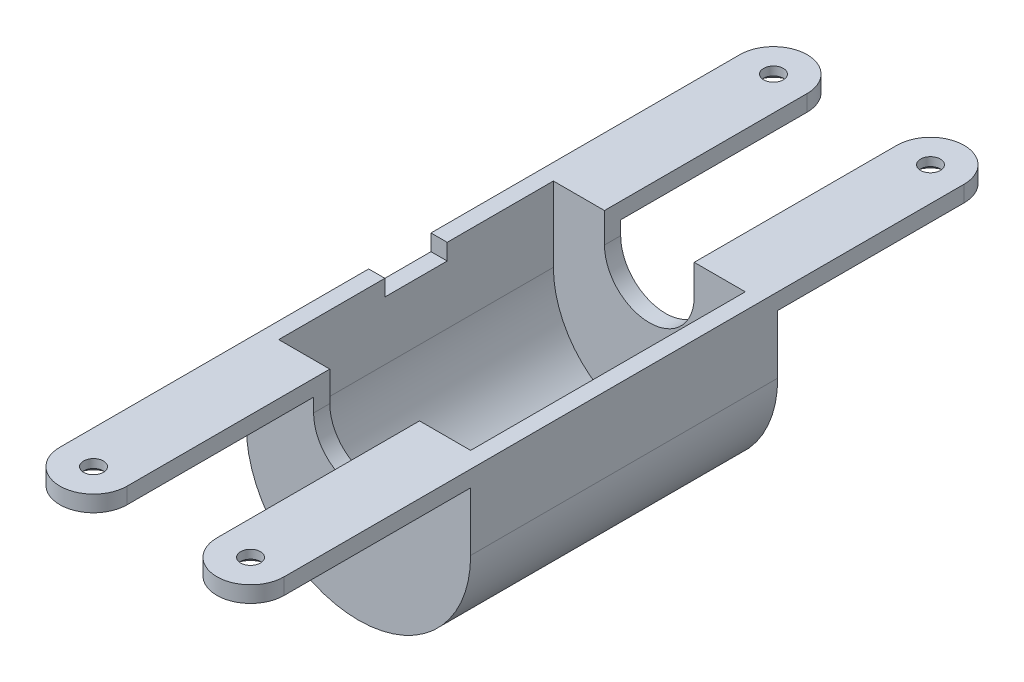
ISO-10303-21;
HEADER;
FILE_DESCRIPTION(('STEP AP214'),'2;1');
FILE_NAME('part.step','',(''),(''),'','','');
FILE_SCHEMA(('AUTOMOTIVE_DESIGN { 1 0 10303 214 1 1 1 1 }'));
ENDSEC;
DATA;
#1=APPLICATION_CONTEXT('core data for automotive mechanical design processes');
#2=APPLICATION_PROTOCOL_DEFINITION('international standard','automotive_design',2000,#1);
#3=PRODUCT_CONTEXT('',#1,'mechanical');
#4=PRODUCT('Part','Part','',(#3));
#5=PRODUCT_RELATED_PRODUCT_CATEGORY('part','',(#4));
#6=PRODUCT_DEFINITION_FORMATION('','',#4);
#7=PRODUCT_DEFINITION_CONTEXT('part definition',#1,'design');
#8=PRODUCT_DEFINITION('design','',#6,#7);
#9=PRODUCT_DEFINITION_SHAPE('','',#8);
#10=(LENGTH_UNIT() NAMED_UNIT(*) SI_UNIT(.MILLI.,.METRE.));
#11=(NAMED_UNIT(*) PLANE_ANGLE_UNIT() SI_UNIT($,.RADIAN.));
#12=(NAMED_UNIT(*) SI_UNIT($,.STERADIAN.) SOLID_ANGLE_UNIT());
#13=UNCERTAINTY_MEASURE_WITH_UNIT(LENGTH_MEASURE(1.E-05),#10,'distance_accuracy_value','');
#14=(GEOMETRIC_REPRESENTATION_CONTEXT(3) GLOBAL_UNCERTAINTY_ASSIGNED_CONTEXT((#13)) GLOBAL_UNIT_ASSIGNED_CONTEXT((#10,
#11,#12)) REPRESENTATION_CONTEXT('',''));
#15=CARTESIAN_POINT('',(0.,0.,0.));
#16=DIRECTION('',(0.,0.,1.));
#17=DIRECTION('',(1.,0.,0.));
#18=AXIS2_PLACEMENT_3D('',#15,#16,#17);
#19=CARTESIAN_POINT('',(-22.86,29.845,190.373));
#20=DIRECTION('',(-1.,0.,0.));
#21=DIRECTION('',(0.,-1.,0.));
#22=AXIS2_PLACEMENT_3D('',#19,#20,#21);
#23=PLANE('',#22);
#24=DIRECTION('',(0.,-1.,0.));
#25=VECTOR('',#24,1.);
#26=CARTESIAN_POINT('',(-22.8600000000001,432.243454709471,173.228));
#27=LINE('',#26,#25);
#28=CARTESIAN_POINT('',(-22.86,38.1,173.228));
#29=VERTEX_POINT('',#28);
#30=CARTESIAN_POINT('',(-22.86,29.845,173.228));
#31=VERTEX_POINT('',#30);
#32=EDGE_CURVE('E450',#29,#31,#27,.T.);
#33=ORIENTED_EDGE('',*,*,#32,.T.);
#34=DIRECTION('',(0.,0.,-1.));
#35=VECTOR('',#34,1.);
#36=CARTESIAN_POINT('',(-22.86,29.845,190.373));
#37=LINE('',#36,#35);
#38=CARTESIAN_POINT('',(-22.86,29.845,78.232));
#39=VERTEX_POINT('',#38);
#40=EDGE_CURVE('E47',#31,#39,#37,.T.);
#41=ORIENTED_EDGE('',*,*,#40,.T.);
#42=DIRECTION('',(0.,1.,0.));
#43=VECTOR('',#42,1.);
#44=CARTESIAN_POINT('',(-22.86,38.1,78.232));
#45=LINE('',#44,#43);
#46=CARTESIAN_POINT('',(-22.86,22.86,78.232));
#47=VERTEX_POINT('',#46);
#48=EDGE_CURVE('E314',#47,#39,#45,.T.);
#49=ORIENTED_EDGE('',*,*,#48,.F.);
#50=DIRECTION('',(0.,0.,-1.));
#51=VECTOR('',#50,1.);
#52=CARTESIAN_POINT('',(-22.86,22.86,78.232));
#53=LINE('',#52,#51);
#54=CARTESIAN_POINT('',(-22.86,22.86,69.977));
#55=VERTEX_POINT('',#54);
#56=EDGE_CURVE('E343',#47,#55,#53,.T.);
#57=ORIENTED_EDGE('',*,*,#56,.T.);
#58=DIRECTION('',(0.,1.,0.));
#59=VECTOR('',#58,1.);
#60=CARTESIAN_POINT('',(-22.86,22.86,69.977));
#61=LINE('',#60,#59);
#62=CARTESIAN_POINT('',(-22.86,38.1,69.977));
#63=VERTEX_POINT('',#62);
#64=EDGE_CURVE('E284',#55,#63,#61,.T.);
#65=ORIENTED_EDGE('',*,*,#64,.T.);
#66=DIRECTION('',(0.,0.,-1.));
#67=VECTOR('',#66,1.);
#68=CARTESIAN_POINT('',(-22.86,38.1,190.373));
#69=LINE('',#68,#67);
#70=EDGE_CURVE('E231',#29,#63,#69,.T.);
#71=ORIENTED_EDGE('',*,*,#70,.F.);
#72=EDGE_LOOP('',(#33,#41,#49,#57,#65,#71));
#73=FACE_BOUND('',#72,.T.);
#74=ADVANCED_FACE('F39',(#73),#23,.F.);
#75=CARTESIAN_POINT('',(-57.15,38.1,190.373));
#76=DIRECTION('',(1.,0.,0.));
#77=DIRECTION('',(0.,0.,-1.));
#78=AXIS2_PLACEMENT_3D('',#75,#76,#77);
#79=PLANE('',#78);
#80=DIRECTION('',(0.,0.,-1.));
#81=VECTOR('',#80,1.);
#82=CARTESIAN_POINT('',(-57.15,29.845,190.373));
#83=LINE('',#82,#81);
#84=CARTESIAN_POINT('',(-57.15,29.845,173.228));
#85=VERTEX_POINT('',#84);
#86=CARTESIAN_POINT('',(-57.15,29.845,78.232));
#87=VERTEX_POINT('',#86);
#88=EDGE_CURVE('E11',#85,#87,#83,.T.);
#89=ORIENTED_EDGE('',*,*,#88,.F.);
#90=DIRECTION('',(0.,-1.,0.));
#91=VECTOR('',#90,1.);
#92=CARTESIAN_POINT('',(-57.1500000000002,432.243454709471,173.228));
#93=LINE('',#92,#91);
#94=CARTESIAN_POINT('',(-57.15,38.1,173.228));
#95=VERTEX_POINT('',#94);
#96=EDGE_CURVE('E229',#95,#85,#93,.T.);
#97=ORIENTED_EDGE('',*,*,#96,.F.);
#98=DIRECTION('',(0.,0.,-1.));
#99=VECTOR('',#98,1.);
#100=CARTESIAN_POINT('',(-57.15,38.1,190.373));
#101=LINE('',#100,#99);
#102=CARTESIAN_POINT('',(-57.15,38.1,15.875));
#103=VERTEX_POINT('',#102);
#104=EDGE_CURVE('E224',#95,#103,#101,.T.);
#105=ORIENTED_EDGE('',*,*,#104,.T.);
#106=DIRECTION('',(0.,-1.,0.));
#107=VECTOR('',#106,1.);
#108=CARTESIAN_POINT('',(-57.15,38.1,15.875));
#109=LINE('',#108,#107);
#110=CARTESIAN_POINT('',(-57.15,29.845,15.875));
#111=VERTEX_POINT('',#110);
#112=EDGE_CURVE('E228',#103,#111,#109,.T.);
#113=ORIENTED_EDGE('',*,*,#112,.T.);
#114=DIRECTION('',(0.,0.,-1.));
#115=VECTOR('',#114,1.);
#116=CARTESIAN_POINT('',(-57.15,29.845,15.875));
#117=LINE('',#116,#115);
#118=CARTESIAN_POINT('',(-57.15,29.845,-15.875));
#119=VERTEX_POINT('',#118);
#120=EDGE_CURVE('E241',#111,#119,#117,.T.);
#121=ORIENTED_EDGE('',*,*,#120,.T.);
#122=DIRECTION('',(0.,1.,0.));
#123=VECTOR('',#122,1.);
#124=CARTESIAN_POINT('',(-57.15,29.845,-15.875));
#125=LINE('',#124,#123);
#126=CARTESIAN_POINT('',(-57.15,38.1,-15.875));
#127=VERTEX_POINT('',#126);
#128=EDGE_CURVE('E248',#119,#127,#125,.T.);
#129=ORIENTED_EDGE('',*,*,#128,.T.);
#130=DIRECTION('',(0.,0.,1.));
#131=VECTOR('',#130,1.);
#132=CARTESIAN_POINT('',(-57.15,38.1,-190.373));
#133=LINE('',#132,#131);
#134=CARTESIAN_POINT('',(-57.15,38.1,-173.228));
#135=VERTEX_POINT('',#134);
#136=EDGE_CURVE('E402',#135,#127,#133,.T.);
#137=ORIENTED_EDGE('',*,*,#136,.F.);
#138=DIRECTION('',(0.,-1.,0.));
#139=VECTOR('',#138,1.);
#140=CARTESIAN_POINT('',(-57.1500000000002,432.243454709471,-173.228));
#141=LINE('',#140,#139);
#142=CARTESIAN_POINT('',(-57.15,29.845,-173.228));
#143=VERTEX_POINT('',#142);
#144=EDGE_CURVE('E389',#135,#143,#141,.T.);
#145=ORIENTED_EDGE('',*,*,#144,.T.);
#146=DIRECTION('',(0.,0.,1.));
#147=VECTOR('',#146,1.);
#148=CARTESIAN_POINT('',(-57.15,29.845,-190.373));
#149=LINE('',#148,#147);
#150=CARTESIAN_POINT('',(-57.15,29.845,-78.232));
#151=VERTEX_POINT('',#150);
#152=EDGE_CURVE('E408',#143,#151,#149,.T.);
#153=ORIENTED_EDGE('',*,*,#152,.T.);
#154=DIRECTION('',(0.,-1.,0.));
#155=VECTOR('',#154,1.);
#156=CARTESIAN_POINT('',(-57.15,38.1,-78.232));
#157=LINE('',#156,#155);
#158=CARTESIAN_POINT('',(-57.15,0.,-78.232));
#159=VERTEX_POINT('',#158);
#160=EDGE_CURVE('E331',#151,#159,#157,.T.);
#161=ORIENTED_EDGE('',*,*,#160,.T.);
#162=DIRECTION('',(0.,0.,-1.));
#163=VECTOR('',#162,1.);
#164=CARTESIAN_POINT('',(-57.15,0.,78.232));
#165=LINE('',#164,#163);
#166=CARTESIAN_POINT('',(-57.15,0.,78.232));
#167=VERTEX_POINT('',#166);
#168=EDGE_CURVE('E339',#167,#159,#165,.T.);
#169=ORIENTED_EDGE('',*,*,#168,.F.);
#170=DIRECTION('',(0.,-1.,0.));
#171=VECTOR('',#170,1.);
#172=CARTESIAN_POINT('',(-57.15,38.1,78.232));
#173=LINE('',#172,#171);
#174=EDGE_CURVE('E316',#87,#167,#173,.T.);
#175=ORIENTED_EDGE('',*,*,#174,.F.);
#176=EDGE_LOOP('',(#89,#97,#105,#113,#121,#129,#137,#145,#153,#161,#169,#175));
#177=FACE_BOUND('',#176,.T.);
#178=ADVANCED_FACE('F41',(#177),#79,.F.);
#179=CARTESIAN_POINT('',(-57.15,29.845,190.373));
#180=DIRECTION('',(0.,1.,0.));
#181=DIRECTION('',(0.,0.,1.));
#182=AXIS2_PLACEMENT_3D('',#179,#180,#181);
#183=PLANE('',#182);
#184=CARTESIAN_POINT('',(-40.005,29.845,173.228));
#185=DIRECTION('',(0.,-1.,0.));
#186=DIRECTION('',(0.,0.,-1.));
#187=AXIS2_PLACEMENT_3D('',#184,#185,#186);
#188=CIRCLE('',#187,9.6774);
#189=CARTESIAN_POINT('',(-40.005,29.845,163.5506));
#190=VERTEX_POINT('',#189);
#191=EDGE_CURVE('E441',#190,#190,#188,.T.);
#192=ORIENTED_EDGE('',*,*,#191,.F.);
#193=EDGE_LOOP('',(#192));
#194=FACE_BOUND('',#193,.T.);
#195=CARTESIAN_POINT('',(-40.005,29.845,173.228));
#196=DIRECTION('',(0.,1.,0.));
#197=DIRECTION('',(0.,0.,1.));
#198=AXIS2_PLACEMENT_3D('',#195,#196,#197);
#199=CIRCLE('',#198,17.145);
#200=EDGE_CURVE('E61',#31,#85,#199,.F.);
#201=ORIENTED_EDGE('',*,*,#200,.T.);
#202=ORIENTED_EDGE('',*,*,#88,.T.);
#203=DIRECTION('',(1.,0.,0.));
#204=VECTOR('',#203,1.);
#205=CARTESIAN_POINT('',(-57.15,29.845,78.232));
#206=LINE('',#205,#204);
#207=EDGE_CURVE('E232',#87,#39,#206,.T.);
#208=ORIENTED_EDGE('',*,*,#207,.T.);
#209=ORIENTED_EDGE('',*,*,#40,.F.);
#210=EDGE_LOOP('',(#201,#202,#208,#209));
#211=FACE_BOUND('',#210,.T.);
#212=ADVANCED_FACE('F462',(#194,#211),#183,.F.);
#213=CARTESIAN_POINT('',(-22.86,38.1,190.373));
#214=DIRECTION('',(0.,-1.,0.));
#215=DIRECTION('',(1.,0.,0.));
#216=AXIS2_PLACEMENT_3D('',#213,#214,#215);
#217=PLANE('',#216);
#218=CARTESIAN_POINT('',(-40.005,38.1,173.228));
#219=DIRECTION('',(0.,-1.,0.));
#220=DIRECTION('',(0.,0.,-1.));
#221=AXIS2_PLACEMENT_3D('',#218,#219,#220);
#222=CIRCLE('',#221,5.0419);
#223=CARTESIAN_POINT('',(-40.005,38.1,168.1861));
#224=VERTEX_POINT('',#223);
#225=EDGE_CURVE('E447',#224,#224,#222,.T.);
#226=ORIENTED_EDGE('',*,*,#225,.T.);
#227=EDGE_LOOP('',(#226));
#228=FACE_BOUND('',#227,.T.);
#229=ORIENTED_EDGE('',*,*,#104,.F.);
#230=CARTESIAN_POINT('',(-40.005,38.1,173.228));
#231=DIRECTION('',(0.,-1.,0.));
#232=DIRECTION('',(1.,0.,0.));
#233=AXIS2_PLACEMENT_3D('',#230,#231,#232);
#234=CIRCLE('',#233,17.145);
#235=EDGE_CURVE('E54',#95,#29,#234,.F.);
#236=ORIENTED_EDGE('',*,*,#235,.T.);
#237=ORIENTED_EDGE('',*,*,#70,.T.);
#238=DIRECTION('',(-1.,0.,0.));
#239=VECTOR('',#238,1.);
#240=CARTESIAN_POINT('',(0.,38.1,69.977));
#241=LINE('',#240,#239);
#242=CARTESIAN_POINT('',(-48.895,38.1,69.977));
#243=VERTEX_POINT('',#242);
#244=EDGE_CURVE('E268',#63,#243,#241,.T.);
#245=ORIENTED_EDGE('',*,*,#244,.T.);
#246=DIRECTION('',(0.,0.,-1.));
#247=VECTOR('',#246,1.);
#248=CARTESIAN_POINT('',(-48.895,38.1,78.232));
#249=LINE('',#248,#247);
#250=CARTESIAN_POINT('',(-48.895,38.1,15.875));
#251=VERTEX_POINT('',#250);
#252=EDGE_CURVE('E247',#243,#251,#249,.T.);
#253=ORIENTED_EDGE('',*,*,#252,.T.);
#254=DIRECTION('',(1.,0.,0.));
#255=VECTOR('',#254,1.);
#256=CARTESIAN_POINT('',(-57.15,38.1,15.875));
#257=LINE('',#256,#255);
#258=EDGE_CURVE('E237',#103,#251,#257,.T.);
#259=ORIENTED_EDGE('',*,*,#258,.F.);
#260=EDGE_LOOP('',(#229,#236,#237,#245,#253,#259));
#261=FACE_BOUND('',#260,.T.);
#262=ADVANCED_FACE('F245',(#228,#261),#217,.F.);
#263=CARTESIAN_POINT('',(-40.0050000000001,432.243454709471,173.228));
#264=DIRECTION('',(0.,-1.,0.));
#265=DIRECTION('',(1.,0.,0.));
#266=AXIS2_PLACEMENT_3D('',#263,#264,#265);
#267=CYLINDRICAL_SURFACE('',#266,17.145);
#268=ORIENTED_EDGE('',*,*,#96,.T.);
#269=ORIENTED_EDGE('',*,*,#200,.F.);
#270=ORIENTED_EDGE('',*,*,#32,.F.);
#271=ORIENTED_EDGE('',*,*,#235,.F.);
#272=EDGE_LOOP('',(#268,#269,#270,#271));
#273=FACE_BOUND('',#272,.T.);
#274=ADVANCED_FACE('F560',(#273),#267,.T.);
#275=CARTESIAN_POINT('',(-40.005,29.845,173.228));
#276=DIRECTION('',(0.,-1.,0.));
#277=DIRECTION('',(0.,0.,-1.));
#278=AXIS2_PLACEMENT_3D('',#275,#276,#277);
#279=CYLINDRICAL_SURFACE('',#278,5.0419);
#280=ORIENTED_EDGE('',*,*,#225,.F.);
#281=EDGE_LOOP('',(#280));
#282=FACE_BOUND('',#281,.T.);
#283=CARTESIAN_POINT('',(-40.005,33.7346463403223,173.228));
#284=DIRECTION('',(0.,-1.,0.));
#285=DIRECTION('',(0.,0.,-1.));
#286=AXIS2_PLACEMENT_3D('',#283,#284,#285);
#287=CIRCLE('',#286,5.0419);
#288=CARTESIAN_POINT('',(-40.005,33.7346463403223,168.1861));
#289=VERTEX_POINT('',#288);
#290=EDGE_CURVE('E444',#289,#289,#287,.T.);
#291=ORIENTED_EDGE('',*,*,#290,.T.);
#292=EDGE_LOOP('',(#291));
#293=FACE_BOUND('',#292,.T.);
#294=ADVANCED_FACE('F566',(#282,#293),#279,.F.);
#295=CARTESIAN_POINT('',(-40.005,29.845,173.228));
#296=DIRECTION('',(0.,-1.,0.));
#297=DIRECTION('',(0.,0.,-1.));
#298=AXIS2_PLACEMENT_3D('',#295,#296,#297);
#299=CONICAL_SURFACE('',#298,9.6774,0.872664625997164);
#300=ORIENTED_EDGE('',*,*,#290,.F.);
#301=EDGE_LOOP('',(#300));
#302=FACE_BOUND('',#301,.T.);
#303=ORIENTED_EDGE('',*,*,#191,.T.);
#304=EDGE_LOOP('',(#303));
#305=FACE_BOUND('',#304,.T.);
#306=ADVANCED_FACE('F564',(#302,#305),#299,.F.);
#307=CARTESIAN_POINT('',(0.,22.86,78.232));
#308=DIRECTION('',(0.,0.,-1.));
#309=DIRECTION('',(-1.,0.,0.));
#310=AXIS2_PLACEMENT_3D('',#307,#308,#309);
#311=PLANE('',#310);
#312=ORIENTED_EDGE('',*,*,#48,.T.);
#313=ORIENTED_EDGE('',*,*,#207,.F.);
#314=ORIENTED_EDGE('',*,*,#174,.T.);
#315=CARTESIAN_POINT('',(0.,0.,78.232));
#316=DIRECTION('',(0.,0.,1.));
#317=DIRECTION('',(-1.,0.,0.));
#318=AXIS2_PLACEMENT_3D('',#315,#316,#317);
#319=CIRCLE('',#318,57.15);
#320=CARTESIAN_POINT('',(57.15,0.,78.232));
#321=VERTEX_POINT('',#320);
#322=EDGE_CURVE('E318',#167,#321,#319,.T.);
#323=ORIENTED_EDGE('',*,*,#322,.T.);
#324=DIRECTION('',(0.,1.,0.));
#325=VECTOR('',#324,1.);
#326=CARTESIAN_POINT('',(57.15,38.1,78.232));
#327=LINE('',#326,#325);
#328=CARTESIAN_POINT('',(57.15,29.845,78.232));
#329=VERTEX_POINT('',#328);
#330=EDGE_CURVE('E320',#321,#329,#327,.T.);
#331=ORIENTED_EDGE('',*,*,#330,.T.);
#332=DIRECTION('',(-1.,0.,0.));
#333=VECTOR('',#332,1.);
#334=CARTESIAN_POINT('',(57.15,29.845,78.232));
#335=LINE('',#334,#333);
#336=CARTESIAN_POINT('',(22.86,29.845,78.232));
#337=VERTEX_POINT('',#336);
#338=EDGE_CURVE('E428',#329,#337,#335,.T.);
#339=ORIENTED_EDGE('',*,*,#338,.T.);
#340=DIRECTION('',(0.,-1.,0.));
#341=VECTOR('',#340,1.);
#342=CARTESIAN_POINT('',(22.86,38.1,78.232));
#343=LINE('',#342,#341);
#344=CARTESIAN_POINT('',(22.86,22.86,78.232));
#345=VERTEX_POINT('',#344);
#346=EDGE_CURVE('E309',#337,#345,#343,.T.);
#347=ORIENTED_EDGE('',*,*,#346,.T.);
#348=CARTESIAN_POINT('',(0.,22.86,78.232));
#349=DIRECTION('',(0.,0.,-1.));
#350=DIRECTION('',(-1.,0.,0.));
#351=AXIS2_PLACEMENT_3D('',#348,#349,#350);
#352=CIRCLE('',#351,22.86);
#353=EDGE_CURVE('E311',#345,#47,#352,.T.);
#354=ORIENTED_EDGE('',*,*,#353,.T.);
#355=EDGE_LOOP('',(#312,#313,#314,#323,#331,#339,#347,#354));
#356=FACE_BOUND('',#355,.T.);
#357=ADVANCED_FACE('F465',(#356),#311,.F.);
#358=CARTESIAN_POINT('',(22.86,29.845,190.373));
#359=DIRECTION('',(1.,0.,0.));
#360=DIRECTION('',(0.,-1.,0.));
#361=AXIS2_PLACEMENT_3D('',#358,#359,#360);
#362=PLANE('',#361);
#363=DIRECTION('',(0.,-1.,0.));
#364=VECTOR('',#363,1.);
#365=CARTESIAN_POINT('',(22.8600000000001,432.243454709471,173.228));
#366=LINE('',#365,#364);
#367=CARTESIAN_POINT('',(22.86,38.1,173.228));
#368=VERTEX_POINT('',#367);
#369=CARTESIAN_POINT('',(22.86,29.845,173.228));
#370=VERTEX_POINT('',#369);
#371=EDGE_CURVE('E420',#368,#370,#366,.T.);
#372=ORIENTED_EDGE('',*,*,#371,.F.);
#373=DIRECTION('',(0.,0.,-1.));
#374=VECTOR('',#373,1.);
#375=CARTESIAN_POINT('',(22.86,38.1,190.373));
#376=LINE('',#375,#374);
#377=CARTESIAN_POINT('',(22.86,38.1,69.977));
#378=VERTEX_POINT('',#377);
#379=EDGE_CURVE('E434',#368,#378,#376,.T.);
#380=ORIENTED_EDGE('',*,*,#379,.T.);
#381=DIRECTION('',(0.,-1.,0.));
#382=VECTOR('',#381,1.);
#383=CARTESIAN_POINT('',(22.86,22.86,69.977));
#384=LINE('',#383,#382);
#385=CARTESIAN_POINT('',(22.86,22.86,69.977));
#386=VERTEX_POINT('',#385);
#387=EDGE_CURVE('E290',#378,#386,#384,.T.);
#388=ORIENTED_EDGE('',*,*,#387,.T.);
#389=DIRECTION('',(0.,0.,-1.));
#390=VECTOR('',#389,1.);
#391=CARTESIAN_POINT('',(22.86,22.86,78.232));
#392=LINE('',#391,#390);
#393=EDGE_CURVE('E347',#345,#386,#392,.T.);
#394=ORIENTED_EDGE('',*,*,#393,.F.);
#395=ORIENTED_EDGE('',*,*,#346,.F.);
#396=DIRECTION('',(0.,0.,-1.));
#397=VECTOR('',#396,1.);
#398=CARTESIAN_POINT('',(22.86,29.845,190.373));
#399=LINE('',#398,#397);
#400=EDGE_CURVE('E436',#370,#337,#399,.T.);
#401=ORIENTED_EDGE('',*,*,#400,.F.);
#402=EDGE_LOOP('',(#372,#380,#388,#394,#395,#401));
#403=FACE_BOUND('',#402,.T.);
#404=ADVANCED_FACE('F486',(#403),#362,.F.);
#405=CARTESIAN_POINT('',(57.15,38.1,190.373));
#406=DIRECTION('',(-1.,0.,0.));
#407=DIRECTION('',(0.,0.,-1.));
#408=AXIS2_PLACEMENT_3D('',#405,#406,#407);
#409=PLANE('',#408);
#410=DIRECTION('',(0.,0.,-1.));
#411=VECTOR('',#410,1.);
#412=CARTESIAN_POINT('',(57.15,29.845,190.373));
#413=LINE('',#412,#411);
#414=CARTESIAN_POINT('',(57.15,29.845,173.228));
#415=VERTEX_POINT('',#414);
#416=EDGE_CURVE('E438',#415,#329,#413,.T.);
#417=ORIENTED_EDGE('',*,*,#416,.T.);
#418=ORIENTED_EDGE('',*,*,#330,.F.);
#419=DIRECTION('',(0.,0.,-1.));
#420=VECTOR('',#419,1.);
#421=CARTESIAN_POINT('',(57.15,0.,78.232));
#422=LINE('',#421,#420);
#423=CARTESIAN_POINT('',(57.15,0.,-78.232));
#424=VERTEX_POINT('',#423);
#425=EDGE_CURVE('E323',#321,#424,#422,.T.);
#426=ORIENTED_EDGE('',*,*,#425,.T.);
#427=DIRECTION('',(0.,1.,0.));
#428=VECTOR('',#427,1.);
#429=CARTESIAN_POINT('',(57.15,38.1,-78.232));
#430=LINE('',#429,#428);
#431=CARTESIAN_POINT('',(57.15,29.845,-78.232));
#432=VERTEX_POINT('',#431);
#433=EDGE_CURVE('E312',#424,#432,#430,.T.);
#434=ORIENTED_EDGE('',*,*,#433,.T.);
#435=DIRECTION('',(0.,0.,1.));
#436=VECTOR('',#435,1.);
#437=CARTESIAN_POINT('',(57.15,29.845,-190.373));
#438=LINE('',#437,#436);
#439=CARTESIAN_POINT('',(57.15,29.845,-173.228));
#440=VERTEX_POINT('',#439);
#441=EDGE_CURVE('E377',#440,#432,#438,.T.);
#442=ORIENTED_EDGE('',*,*,#441,.F.);
#443=DIRECTION('',(0.,-1.,0.));
#444=VECTOR('',#443,1.);
#445=CARTESIAN_POINT('',(57.1500000000002,432.243454709471,-173.228));
#446=LINE('',#445,#444);
#447=CARTESIAN_POINT('',(57.15,38.1,-173.228));
#448=VERTEX_POINT('',#447);
#449=EDGE_CURVE('E359',#448,#440,#446,.T.);
#450=ORIENTED_EDGE('',*,*,#449,.F.);
#451=DIRECTION('',(0.,0.,-1.));
#452=VECTOR('',#451,1.);
#453=CARTESIAN_POINT('',(57.15,38.1,190.373));
#454=LINE('',#453,#452);
#455=CARTESIAN_POINT('',(57.15,38.1,173.228));
#456=VERTEX_POINT('',#455);
#457=EDGE_CURVE('E432',#456,#448,#454,.T.);
#458=ORIENTED_EDGE('',*,*,#457,.F.);
#459=DIRECTION('',(0.,-1.,0.));
#460=VECTOR('',#459,1.);
#461=CARTESIAN_POINT('',(57.1500000000002,432.243454709471,173.228));
#462=LINE('',#461,#460);
#463=EDGE_CURVE('E419',#456,#415,#462,.T.);
#464=ORIENTED_EDGE('',*,*,#463,.T.);
#465=EDGE_LOOP('',(#417,#418,#426,#434,#442,#450,#458,#464));
#466=FACE_BOUND('',#465,.T.);
#467=ADVANCED_FACE('F476',(#466),#409,.F.);
#468=CARTESIAN_POINT('',(57.15,29.845,190.373));
#469=DIRECTION('',(0.,1.,0.));
#470=DIRECTION('',(0.,0.,1.));
#471=AXIS2_PLACEMENT_3D('',#468,#469,#470);
#472=PLANE('',#471);
#473=CARTESIAN_POINT('',(40.005,29.845,173.228));
#474=DIRECTION('',(0.,1.,0.));
#475=DIRECTION('',(0.,0.,-1.));
#476=AXIS2_PLACEMENT_3D('',#473,#474,#475);
#477=CIRCLE('',#476,9.6774);
#478=CARTESIAN_POINT('',(40.005,29.845,163.5506));
#479=VERTEX_POINT('',#478);
#480=EDGE_CURVE('E410',#479,#479,#477,.T.);
#481=ORIENTED_EDGE('',*,*,#480,.T.);
#482=EDGE_LOOP('',(#481));
#483=FACE_BOUND('',#482,.T.);
#484=CARTESIAN_POINT('',(40.005,29.845,173.228));
#485=DIRECTION('',(0.,-1.,0.));
#486=DIRECTION('',(0.,0.,1.));
#487=AXIS2_PLACEMENT_3D('',#484,#485,#486);
#488=CIRCLE('',#487,17.145);
#489=EDGE_CURVE('E423',#370,#415,#488,.F.);
#490=ORIENTED_EDGE('',*,*,#489,.F.);
#491=ORIENTED_EDGE('',*,*,#400,.T.);
#492=ORIENTED_EDGE('',*,*,#338,.F.);
#493=ORIENTED_EDGE('',*,*,#416,.F.);
#494=EDGE_LOOP('',(#490,#491,#492,#493));
#495=FACE_BOUND('',#494,.T.);
#496=ADVANCED_FACE('F482',(#483,#495),#472,.F.);
#497=CARTESIAN_POINT('',(22.86,38.1,190.373));
#498=DIRECTION('',(0.,-1.,0.));
#499=DIRECTION('',(-1.,0.,0.));
#500=AXIS2_PLACEMENT_3D('',#497,#498,#499);
#501=PLANE('',#500);
#502=CARTESIAN_POINT('',(40.005,38.1,173.228));
#503=DIRECTION('',(0.,1.,0.));
#504=DIRECTION('',(0.,0.,-1.));
#505=AXIS2_PLACEMENT_3D('',#502,#503,#504);
#506=CIRCLE('',#505,5.0419);
#507=CARTESIAN_POINT('',(40.005,38.1,168.1861));
#508=VERTEX_POINT('',#507);
#509=EDGE_CURVE('E416',#508,#508,#506,.T.);
#510=ORIENTED_EDGE('',*,*,#509,.F.);
#511=EDGE_LOOP('',(#510));
#512=FACE_BOUND('',#511,.T.);
#513=ORIENTED_EDGE('',*,*,#457,.T.);
#514=CARTESIAN_POINT('',(40.005,38.1,-173.228));
#515=DIRECTION('',(0.,-1.,0.));
#516=DIRECTION('',(-1.,0.,0.));
#517=AXIS2_PLACEMENT_3D('',#514,#515,#516);
#518=CIRCLE('',#517,17.145);
#519=CARTESIAN_POINT('',(22.86,38.1,-173.228));
#520=VERTEX_POINT('',#519);
#521=EDGE_CURVE('E366',#448,#520,#518,.F.);
#522=ORIENTED_EDGE('',*,*,#521,.T.);
#523=DIRECTION('',(0.,0.,1.));
#524=VECTOR('',#523,1.);
#525=CARTESIAN_POINT('',(22.86,38.1,-190.373));
#526=LINE('',#525,#524);
#527=CARTESIAN_POINT('',(22.86,38.1,-69.977));
#528=VERTEX_POINT('',#527);
#529=EDGE_CURVE('E372',#520,#528,#526,.T.);
#530=ORIENTED_EDGE('',*,*,#529,.T.);
#531=DIRECTION('',(-1.,0.,0.));
#532=VECTOR('',#531,1.);
#533=CARTESIAN_POINT('',(0.,38.1,-69.977));
#534=LINE('',#533,#532);
#535=CARTESIAN_POINT('',(48.895,38.1,-69.977));
#536=VERTEX_POINT('',#535);
#537=EDGE_CURVE('E277',#536,#528,#534,.T.);
#538=ORIENTED_EDGE('',*,*,#537,.F.);
#539=DIRECTION('',(0.,0.,-1.));
#540=VECTOR('',#539,1.);
#541=CARTESIAN_POINT('',(48.895,38.1,78.232));
#542=LINE('',#541,#540);
#543=CARTESIAN_POINT('',(48.895,38.1,69.977));
#544=VERTEX_POINT('',#543);
#545=EDGE_CURVE('E273',#544,#536,#542,.T.);
#546=ORIENTED_EDGE('',*,*,#545,.F.);
#547=DIRECTION('',(-1.,0.,0.));
#548=VECTOR('',#547,1.);
#549=CARTESIAN_POINT('',(0.,38.1,69.977));
#550=LINE('',#549,#548);
#551=EDGE_CURVE('E280',#544,#378,#550,.T.);
#552=ORIENTED_EDGE('',*,*,#551,.T.);
#553=ORIENTED_EDGE('',*,*,#379,.F.);
#554=CARTESIAN_POINT('',(40.005,38.1,173.228));
#555=DIRECTION('',(0.,1.,0.));
#556=DIRECTION('',(-1.,0.,0.));
#557=AXIS2_PLACEMENT_3D('',#554,#555,#556);
#558=CIRCLE('',#557,17.145);
#559=EDGE_CURVE('E426',#456,#368,#558,.F.);
#560=ORIENTED_EDGE('',*,*,#559,.F.);
#561=EDGE_LOOP('',(#513,#522,#530,#538,#546,#552,#553,#560));
#562=FACE_BOUND('',#561,.T.);
#563=CARTESIAN_POINT('',(40.005,38.1,-173.228));
#564=DIRECTION('',(0.,-1.,0.));
#565=DIRECTION('',(0.,0.,1.));
#566=AXIS2_PLACEMENT_3D('',#563,#564,#565);
#567=CIRCLE('',#566,5.0419);
#568=CARTESIAN_POINT('',(40.005,38.1,-168.1861));
#569=VERTEX_POINT('',#568);
#570=EDGE_CURVE('E356',#569,#569,#567,.T.);
#571=ORIENTED_EDGE('',*,*,#570,.T.);
#572=EDGE_LOOP('',(#571));
#573=FACE_BOUND('',#572,.T.);
#574=ADVANCED_FACE('F492',(#512,#562,#573),#501,.F.);
#575=CARTESIAN_POINT('',(40.0050000000001,432.243454709471,173.228));
#576=DIRECTION('',(0.,-1.,0.));
#577=DIRECTION('',(-1.,0.,0.));
#578=AXIS2_PLACEMENT_3D('',#575,#576,#577);
#579=CYLINDRICAL_SURFACE('',#578,17.145);
#580=ORIENTED_EDGE('',*,*,#463,.F.);
#581=ORIENTED_EDGE('',*,*,#559,.T.);
#582=ORIENTED_EDGE('',*,*,#371,.T.);
#583=ORIENTED_EDGE('',*,*,#489,.T.);
#584=EDGE_LOOP('',(#580,#581,#582,#583));
#585=FACE_BOUND('',#584,.T.);
#586=ADVANCED_FACE('F489',(#585),#579,.T.);
#587=CARTESIAN_POINT('',(40.005,29.845,173.228));
#588=DIRECTION('',(0.,-1.,0.));
#589=DIRECTION('',(0.,0.,-1.));
#590=AXIS2_PLACEMENT_3D('',#587,#588,#589);
#591=CYLINDRICAL_SURFACE('',#590,5.0419);
#592=ORIENTED_EDGE('',*,*,#509,.T.);
#593=EDGE_LOOP('',(#592));
#594=FACE_BOUND('',#593,.T.);
#595=CARTESIAN_POINT('',(40.005,33.7346463403223,173.228));
#596=DIRECTION('',(0.,1.,0.));
#597=DIRECTION('',(0.,0.,-1.));
#598=AXIS2_PLACEMENT_3D('',#595,#596,#597);
#599=CIRCLE('',#598,5.0419);
#600=CARTESIAN_POINT('',(40.005,33.7346463403223,168.1861));
#601=VERTEX_POINT('',#600);
#602=EDGE_CURVE('E413',#601,#601,#599,.T.);
#603=ORIENTED_EDGE('',*,*,#602,.F.);
#604=EDGE_LOOP('',(#603));
#605=FACE_BOUND('',#604,.T.);
#606=ADVANCED_FACE('F651',(#594,#605),#591,.F.);
#607=CARTESIAN_POINT('',(40.005,29.845,173.228));
#608=DIRECTION('',(0.,-1.,0.));
#609=DIRECTION('',(0.,0.,-1.));
#610=AXIS2_PLACEMENT_3D('',#607,#608,#609);
#611=CONICAL_SURFACE('',#610,9.6774,0.872664625997164);
#612=ORIENTED_EDGE('',*,*,#602,.T.);
#613=EDGE_LOOP('',(#612));
#614=FACE_BOUND('',#613,.T.);
#615=ORIENTED_EDGE('',*,*,#480,.F.);
#616=EDGE_LOOP('',(#615));
#617=FACE_BOUND('',#616,.T.);
#618=ADVANCED_FACE('F661',(#614,#617),#611,.F.);
#619=CARTESIAN_POINT('',(-22.86,29.845,-190.373));
#620=DIRECTION('',(-1.,0.,0.));
#621=DIRECTION('',(0.,-1.,0.));
#622=AXIS2_PLACEMENT_3D('',#619,#620,#621);
#623=PLANE('',#622);
#624=DIRECTION('',(0.,-1.,0.));
#625=VECTOR('',#624,1.);
#626=CARTESIAN_POINT('',(-22.8600000000001,432.243454709471,-173.228));
#627=LINE('',#626,#625);
#628=CARTESIAN_POINT('',(-22.86,38.1,-173.228));
#629=VERTEX_POINT('',#628);
#630=CARTESIAN_POINT('',(-22.86,29.845,-173.228));
#631=VERTEX_POINT('',#630);
#632=EDGE_CURVE('E390',#629,#631,#627,.T.);
#633=ORIENTED_EDGE('',*,*,#632,.F.);
#634=DIRECTION('',(0.,0.,1.));
#635=VECTOR('',#634,1.);
#636=CARTESIAN_POINT('',(-22.86,38.1,-190.373));
#637=LINE('',#636,#635);
#638=CARTESIAN_POINT('',(-22.86,38.1,-69.977));
#639=VERTEX_POINT('',#638);
#640=EDGE_CURVE('E404',#629,#639,#637,.T.);
#641=ORIENTED_EDGE('',*,*,#640,.T.);
#642=DIRECTION('',(0.,1.,0.));
#643=VECTOR('',#642,1.);
#644=CARTESIAN_POINT('',(-22.86,22.86,-69.977));
#645=LINE('',#644,#643);
#646=CARTESIAN_POINT('',(-22.86,22.86,-69.977));
#647=VERTEX_POINT('',#646);
#648=EDGE_CURVE('E304',#647,#639,#645,.T.);
#649=ORIENTED_EDGE('',*,*,#648,.F.);
#650=CARTESIAN_POINT('',(-22.86,22.86,-78.232));
#651=VERTEX_POINT('',#650);
#652=EDGE_CURVE('E342',#647,#651,#53,.T.);
#653=ORIENTED_EDGE('',*,*,#652,.T.);
#654=DIRECTION('',(0.,1.,0.));
#655=VECTOR('',#654,1.);
#656=CARTESIAN_POINT('',(-22.86,38.1,-78.232));
#657=LINE('',#656,#655);
#658=CARTESIAN_POINT('',(-22.86,29.845,-78.232));
#659=VERTEX_POINT('',#658);
#660=EDGE_CURVE('E328',#651,#659,#657,.T.);
#661=ORIENTED_EDGE('',*,*,#660,.T.);
#662=DIRECTION('',(0.,0.,1.));
#663=VECTOR('',#662,1.);
#664=CARTESIAN_POINT('',(-22.86,29.845,-190.373));
#665=LINE('',#664,#663);
#666=EDGE_CURVE('E406',#631,#659,#665,.T.);
#667=ORIENTED_EDGE('',*,*,#666,.F.);
#668=EDGE_LOOP('',(#633,#641,#649,#653,#661,#667));
#669=FACE_BOUND('',#668,.T.);
#670=ADVANCED_FACE('F671',(#669),#623,.F.);
#671=CARTESIAN_POINT('',(-57.15,29.845,-190.373));
#672=DIRECTION('',(0.,1.,0.));
#673=DIRECTION('',(0.,0.,-1.));
#674=AXIS2_PLACEMENT_3D('',#671,#672,#673);
#675=PLANE('',#674);
#676=CARTESIAN_POINT('',(-40.005,29.845,-173.228));
#677=DIRECTION('',(0.,1.,0.));
#678=DIRECTION('',(0.,0.,1.));
#679=AXIS2_PLACEMENT_3D('',#676,#677,#678);
#680=CIRCLE('',#679,9.6774);
#681=CARTESIAN_POINT('',(-40.005,29.845,-163.5506));
#682=VERTEX_POINT('',#681);
#683=EDGE_CURVE('E380',#682,#682,#680,.T.);
#684=ORIENTED_EDGE('',*,*,#683,.T.);
#685=EDGE_LOOP('',(#684));
#686=FACE_BOUND('',#685,.T.);
#687=CARTESIAN_POINT('',(-40.005,29.845,-173.228));
#688=DIRECTION('',(0.,-1.,0.));
#689=DIRECTION('',(0.,0.,-1.));
#690=AXIS2_PLACEMENT_3D('',#687,#688,#689);
#691=CIRCLE('',#690,17.145);
#692=EDGE_CURVE('E393',#631,#143,#691,.F.);
#693=ORIENTED_EDGE('',*,*,#692,.F.);
#694=ORIENTED_EDGE('',*,*,#666,.T.);
#695=DIRECTION('',(1.,0.,0.));
#696=VECTOR('',#695,1.);
#697=CARTESIAN_POINT('',(-57.15,29.845,-78.232));
#698=LINE('',#697,#696);
#699=EDGE_CURVE('E398',#151,#659,#698,.T.);
#700=ORIENTED_EDGE('',*,*,#699,.F.);
#701=ORIENTED_EDGE('',*,*,#152,.F.);
#702=EDGE_LOOP('',(#693,#694,#700,#701));
#703=FACE_BOUND('',#702,.T.);
#704=ADVANCED_FACE('F681',(#686,#703),#675,.F.);
#705=CARTESIAN_POINT('',(-22.86,38.1,-190.373));
#706=DIRECTION('',(0.,-1.,0.));
#707=DIRECTION('',(1.,0.,0.));
#708=AXIS2_PLACEMENT_3D('',#705,#706,#707);
#709=PLANE('',#708);
#710=CARTESIAN_POINT('',(-40.005,38.1,-173.228));
#711=DIRECTION('',(0.,1.,0.));
#712=DIRECTION('',(0.,0.,1.));
#713=AXIS2_PLACEMENT_3D('',#710,#711,#712);
#714=CIRCLE('',#713,5.0419);
#715=CARTESIAN_POINT('',(-40.005,38.1,-168.1861));
#716=VERTEX_POINT('',#715);
#717=EDGE_CURVE('E386',#716,#716,#714,.T.);
#718=ORIENTED_EDGE('',*,*,#717,.F.);
#719=EDGE_LOOP('',(#718));
#720=FACE_BOUND('',#719,.T.);
#721=ORIENTED_EDGE('',*,*,#136,.T.);
#722=DIRECTION('',(1.,0.,0.));
#723=VECTOR('',#722,1.);
#724=CARTESIAN_POINT('',(-57.15,38.1,-15.875));
#725=LINE('',#724,#723);
#726=CARTESIAN_POINT('',(-48.895,38.1,-15.875));
#727=VERTEX_POINT('',#726);
#728=EDGE_CURVE('E302',#127,#727,#725,.T.);
#729=ORIENTED_EDGE('',*,*,#728,.T.);
#730=CARTESIAN_POINT('',(-48.895,38.1,-69.977));
#731=VERTEX_POINT('',#730);
#732=EDGE_CURVE('E263',#727,#731,#249,.T.);
#733=ORIENTED_EDGE('',*,*,#732,.T.);
#734=DIRECTION('',(-1.,0.,0.));
#735=VECTOR('',#734,1.);
#736=CARTESIAN_POINT('',(0.,38.1,-69.977));
#737=LINE('',#736,#735);
#738=EDGE_CURVE('E259',#639,#731,#737,.T.);
#739=ORIENTED_EDGE('',*,*,#738,.F.);
#740=ORIENTED_EDGE('',*,*,#640,.F.);
#741=CARTESIAN_POINT('',(-40.005,38.1,-173.228));
#742=DIRECTION('',(0.,1.,0.));
#743=DIRECTION('',(1.,0.,0.));
#744=AXIS2_PLACEMENT_3D('',#741,#742,#743);
#745=CIRCLE('',#744,17.145);
#746=EDGE_CURVE('E396',#135,#629,#745,.F.);
#747=ORIENTED_EDGE('',*,*,#746,.F.);
#748=EDGE_LOOP('',(#721,#729,#733,#739,#740,#747));
#749=FACE_BOUND('',#748,.T.);
#750=ADVANCED_FACE('F523',(#720,#749),#709,.F.);
#751=CARTESIAN_POINT('',(-40.0050000000001,432.243454709471,-173.228));
#752=DIRECTION('',(0.,-1.,0.));
#753=DIRECTION('',(1.,0.,0.));
#754=AXIS2_PLACEMENT_3D('',#751,#752,#753);
#755=CYLINDRICAL_SURFACE('',#754,17.145);
#756=ORIENTED_EDGE('',*,*,#144,.F.);
#757=ORIENTED_EDGE('',*,*,#746,.T.);
#758=ORIENTED_EDGE('',*,*,#632,.T.);
#759=ORIENTED_EDGE('',*,*,#692,.T.);
#760=EDGE_LOOP('',(#756,#757,#758,#759));
#761=FACE_BOUND('',#760,.T.);
#762=ADVANCED_FACE('F701',(#761),#755,.T.);
#763=CARTESIAN_POINT('',(-40.005,29.845,-173.228));
#764=DIRECTION('',(0.,-1.,0.));
#765=DIRECTION('',(0.,0.,1.));
#766=AXIS2_PLACEMENT_3D('',#763,#764,#765);
#767=CYLINDRICAL_SURFACE('',#766,5.0419);
#768=ORIENTED_EDGE('',*,*,#717,.T.);
#769=EDGE_LOOP('',(#768));
#770=FACE_BOUND('',#769,.T.);
#771=CARTESIAN_POINT('',(-40.005,33.7346463403223,-173.228));
#772=DIRECTION('',(0.,1.,0.));
#773=DIRECTION('',(0.,0.,1.));
#774=AXIS2_PLACEMENT_3D('',#771,#772,#773);
#775=CIRCLE('',#774,5.0419);
#776=CARTESIAN_POINT('',(-40.005,33.7346463403223,-168.1861));
#777=VERTEX_POINT('',#776);
#778=EDGE_CURVE('E383',#777,#777,#775,.T.);
#779=ORIENTED_EDGE('',*,*,#778,.F.);
#780=EDGE_LOOP('',(#779));
#781=FACE_BOUND('',#780,.T.);
#782=ADVANCED_FACE('F712',(#770,#781),#767,.F.);
#783=CARTESIAN_POINT('',(-40.005,29.845,-173.228));
#784=DIRECTION('',(0.,-1.,0.));
#785=DIRECTION('',(0.,0.,1.));
#786=AXIS2_PLACEMENT_3D('',#783,#784,#785);
#787=CONICAL_SURFACE('',#786,9.6774,0.872664625997164);
#788=ORIENTED_EDGE('',*,*,#778,.T.);
#789=EDGE_LOOP('',(#788));
#790=FACE_BOUND('',#789,.T.);
#791=ORIENTED_EDGE('',*,*,#683,.F.);
#792=EDGE_LOOP('',(#791));
#793=FACE_BOUND('',#792,.T.);
#794=ADVANCED_FACE('F722',(#790,#793),#787,.F.);
#795=CARTESIAN_POINT('',(0.,22.86,-78.232));
#796=DIRECTION('',(0.,0.,-1.));
#797=DIRECTION('',(-1.,0.,0.));
#798=AXIS2_PLACEMENT_3D('',#795,#796,#797);
#799=PLANE('',#798);
#800=ORIENTED_EDGE('',*,*,#699,.T.);
#801=ORIENTED_EDGE('',*,*,#660,.F.);
#802=CARTESIAN_POINT('',(0.,22.86,-78.232));
#803=DIRECTION('',(0.,0.,-1.));
#804=DIRECTION('',(-1.,0.,0.));
#805=AXIS2_PLACEMENT_3D('',#802,#803,#804);
#806=CIRCLE('',#805,22.86);
#807=CARTESIAN_POINT('',(22.86,22.86,-78.232));
#808=VERTEX_POINT('',#807);
#809=EDGE_CURVE('E325',#808,#651,#806,.T.);
#810=ORIENTED_EDGE('',*,*,#809,.F.);
#811=DIRECTION('',(0.,-1.,0.));
#812=VECTOR('',#811,1.);
#813=CARTESIAN_POINT('',(22.86,38.1,-78.232));
#814=LINE('',#813,#812);
#815=CARTESIAN_POINT('',(22.86,29.845,-78.232));
#816=VERTEX_POINT('',#815);
#817=EDGE_CURVE('E282',#816,#808,#814,.T.);
#818=ORIENTED_EDGE('',*,*,#817,.F.);
#819=DIRECTION('',(-1.,0.,0.));
#820=VECTOR('',#819,1.);
#821=CARTESIAN_POINT('',(57.15,29.845,-78.232));
#822=LINE('',#821,#820);
#823=EDGE_CURVE('E368',#432,#816,#822,.T.);
#824=ORIENTED_EDGE('',*,*,#823,.F.);
#825=ORIENTED_EDGE('',*,*,#433,.F.);
#826=CARTESIAN_POINT('',(0.,0.,-78.232));
#827=DIRECTION('',(0.,0.,1.));
#828=DIRECTION('',(-1.,0.,0.));
#829=AXIS2_PLACEMENT_3D('',#826,#827,#828);
#830=CIRCLE('',#829,57.15);
#831=EDGE_CURVE('E333',#159,#424,#830,.T.);
#832=ORIENTED_EDGE('',*,*,#831,.F.);
#833=ORIENTED_EDGE('',*,*,#160,.F.);
#834=EDGE_LOOP('',(#800,#801,#810,#818,#824,#825,#832,#833));
#835=FACE_BOUND('',#834,.T.);
#836=ADVANCED_FACE('F732',(#835),#799,.T.);
#837=CARTESIAN_POINT('',(22.86,29.845,-190.373));
#838=DIRECTION('',(1.,0.,0.));
#839=DIRECTION('',(0.,-1.,0.));
#840=AXIS2_PLACEMENT_3D('',#837,#838,#839);
#841=PLANE('',#840);
#842=DIRECTION('',(0.,-1.,0.));
#843=VECTOR('',#842,1.);
#844=CARTESIAN_POINT('',(22.8600000000001,432.243454709471,-173.228));
#845=LINE('',#844,#843);
#846=CARTESIAN_POINT('',(22.86,29.845,-173.228));
#847=VERTEX_POINT('',#846);
#848=EDGE_CURVE('E360',#520,#847,#845,.T.);
#849=ORIENTED_EDGE('',*,*,#848,.T.);
#850=DIRECTION('',(0.,0.,1.));
#851=VECTOR('',#850,1.);
#852=CARTESIAN_POINT('',(22.86,29.845,-190.373));
#853=LINE('',#852,#851);
#854=EDGE_CURVE('E374',#847,#816,#853,.T.);
#855=ORIENTED_EDGE('',*,*,#854,.T.);
#856=ORIENTED_EDGE('',*,*,#817,.T.);
#857=CARTESIAN_POINT('',(22.86,22.86,-69.977));
#858=VERTEX_POINT('',#857);
#859=EDGE_CURVE('E346',#858,#808,#392,.T.);
#860=ORIENTED_EDGE('',*,*,#859,.F.);
#861=DIRECTION('',(0.,-1.,0.));
#862=VECTOR('',#861,1.);
#863=CARTESIAN_POINT('',(22.86,22.86,-69.977));
#864=LINE('',#863,#862);
#865=EDGE_CURVE('E299',#528,#858,#864,.T.);
#866=ORIENTED_EDGE('',*,*,#865,.F.);
#867=ORIENTED_EDGE('',*,*,#529,.F.);
#868=EDGE_LOOP('',(#849,#855,#856,#860,#866,#867));
#869=FACE_BOUND('',#868,.T.);
#870=ADVANCED_FACE('F742',(#869),#841,.F.);
#871=CARTESIAN_POINT('',(57.15,29.845,-190.373));
#872=DIRECTION('',(0.,1.,0.));
#873=DIRECTION('',(0.,0.,-1.));
#874=AXIS2_PLACEMENT_3D('',#871,#872,#873);
#875=PLANE('',#874);
#876=CARTESIAN_POINT('',(40.005,29.845,-173.228));
#877=DIRECTION('',(0.,-1.,0.));
#878=DIRECTION('',(0.,0.,1.));
#879=AXIS2_PLACEMENT_3D('',#876,#877,#878);
#880=CIRCLE('',#879,9.6774);
#881=CARTESIAN_POINT('',(40.005,29.845,-163.5506));
#882=VERTEX_POINT('',#881);
#883=EDGE_CURVE('E350',#882,#882,#880,.T.);
#884=ORIENTED_EDGE('',*,*,#883,.F.);
#885=EDGE_LOOP('',(#884));
#886=FACE_BOUND('',#885,.T.);
#887=CARTESIAN_POINT('',(40.005,29.845,-173.228));
#888=DIRECTION('',(0.,1.,0.));
#889=DIRECTION('',(0.,0.,-1.));
#890=AXIS2_PLACEMENT_3D('',#887,#888,#889);
#891=CIRCLE('',#890,17.145);
#892=EDGE_CURVE('E363',#847,#440,#891,.F.);
#893=ORIENTED_EDGE('',*,*,#892,.T.);
#894=ORIENTED_EDGE('',*,*,#441,.T.);
#895=ORIENTED_EDGE('',*,*,#823,.T.);
#896=ORIENTED_EDGE('',*,*,#854,.F.);
#897=EDGE_LOOP('',(#893,#894,#895,#896));
#898=FACE_BOUND('',#897,.T.);
#899=ADVANCED_FACE('F752',(#886,#898),#875,.F.);
#900=CARTESIAN_POINT('',(40.0050000000001,432.243454709471,-173.228));
#901=DIRECTION('',(0.,-1.,0.));
#902=DIRECTION('',(-1.,0.,0.));
#903=AXIS2_PLACEMENT_3D('',#900,#901,#902);
#904=CYLINDRICAL_SURFACE('',#903,17.145);
#905=ORIENTED_EDGE('',*,*,#449,.T.);
#906=ORIENTED_EDGE('',*,*,#892,.F.);
#907=ORIENTED_EDGE('',*,*,#848,.F.);
#908=ORIENTED_EDGE('',*,*,#521,.F.);
#909=EDGE_LOOP('',(#905,#906,#907,#908));
#910=FACE_BOUND('',#909,.T.);
#911=ADVANCED_FACE('F763',(#910),#904,.T.);
#912=CARTESIAN_POINT('',(40.005,29.845,-173.228));
#913=DIRECTION('',(0.,-1.,0.));
#914=DIRECTION('',(0.,0.,1.));
#915=AXIS2_PLACEMENT_3D('',#912,#913,#914);
#916=CYLINDRICAL_SURFACE('',#915,5.0419);
#917=ORIENTED_EDGE('',*,*,#570,.F.);
#918=EDGE_LOOP('',(#917));
#919=FACE_BOUND('',#918,.T.);
#920=CARTESIAN_POINT('',(40.005,33.7346463403223,-173.228));
#921=DIRECTION('',(0.,-1.,0.));
#922=DIRECTION('',(0.,0.,1.));
#923=AXIS2_PLACEMENT_3D('',#920,#921,#922);
#924=CIRCLE('',#923,5.0419);
#925=CARTESIAN_POINT('',(40.005,33.7346463403223,-168.1861));
#926=VERTEX_POINT('',#925);
#927=EDGE_CURVE('E353',#926,#926,#924,.T.);
#928=ORIENTED_EDGE('',*,*,#927,.T.);
#929=EDGE_LOOP('',(#928));
#930=FACE_BOUND('',#929,.T.);
#931=ADVANCED_FACE('F773',(#919,#930),#916,.F.);
#932=CARTESIAN_POINT('',(40.005,29.845,-173.228));
#933=DIRECTION('',(0.,-1.,0.));
#934=DIRECTION('',(0.,0.,1.));
#935=AXIS2_PLACEMENT_3D('',#932,#933,#934);
#936=CONICAL_SURFACE('',#935,9.6774,0.872664625997164);
#937=ORIENTED_EDGE('',*,*,#927,.F.);
#938=EDGE_LOOP('',(#937));
#939=FACE_BOUND('',#938,.T.);
#940=ORIENTED_EDGE('',*,*,#883,.T.);
#941=EDGE_LOOP('',(#940));
#942=FACE_BOUND('',#941,.T.);
#943=ADVANCED_FACE('F783',(#939,#942),#936,.F.);
#944=CARTESIAN_POINT('',(0.,22.86,78.232));
#945=DIRECTION('',(0.,0.,-1.));
#946=DIRECTION('',(-1.,0.,0.));
#947=AXIS2_PLACEMENT_3D('',#944,#945,#946);
#948=CYLINDRICAL_SURFACE('',#947,22.86);
#949=CARTESIAN_POINT('',(0.,22.86,-69.977));
#950=DIRECTION('',(0.,0.,-1.));
#951=DIRECTION('',(-1.,0.,0.));
#952=AXIS2_PLACEMENT_3D('',#949,#950,#951);
#953=CIRCLE('',#952,22.86);
#954=EDGE_CURVE('E301',#858,#647,#953,.T.);
#955=ORIENTED_EDGE('',*,*,#954,.F.);
#956=ORIENTED_EDGE('',*,*,#859,.T.);
#957=ORIENTED_EDGE('',*,*,#809,.T.);
#958=ORIENTED_EDGE('',*,*,#652,.F.);
#959=EDGE_LOOP('',(#955,#956,#957,#958));
#960=FACE_BOUND('',#959,.T.);
#961=ADVANCED_FACE('F793',(#960),#948,.F.);
#962=ORIENTED_EDGE('',*,*,#393,.T.);
#963=CARTESIAN_POINT('',(0.,22.86,69.977));
#964=DIRECTION('',(0.,0.,-1.));
#965=DIRECTION('',(-1.,0.,0.));
#966=AXIS2_PLACEMENT_3D('',#963,#964,#965);
#967=CIRCLE('',#966,22.86);
#968=EDGE_CURVE('E287',#386,#55,#967,.T.);
#969=ORIENTED_EDGE('',*,*,#968,.T.);
#970=ORIENTED_EDGE('',*,*,#56,.F.);
#971=ORIENTED_EDGE('',*,*,#353,.F.);
#972=EDGE_LOOP('',(#962,#969,#970,#971));
#973=FACE_BOUND('',#972,.T.);
#974=ADVANCED_FACE('F502',(#973),#948,.F.);
#975=CARTESIAN_POINT('',(0.,0.,78.232));
#976=DIRECTION('',(0.,0.,-1.));
#977=DIRECTION('',(-1.,0.,0.));
#978=AXIS2_PLACEMENT_3D('',#975,#976,#977);
#979=CYLINDRICAL_SURFACE('',#978,57.15);
#980=ORIENTED_EDGE('',*,*,#831,.T.);
#981=ORIENTED_EDGE('',*,*,#425,.F.);
#982=ORIENTED_EDGE('',*,*,#322,.F.);
#983=ORIENTED_EDGE('',*,*,#168,.T.);
#984=EDGE_LOOP('',(#980,#981,#982,#983));
#985=FACE_BOUND('',#984,.T.);
#986=ADVANCED_FACE('F472',(#985),#979,.T.);
#987=CARTESIAN_POINT('',(-48.895,38.1,78.232));
#988=DIRECTION('',(1.,0.,0.));
#989=DIRECTION('',(0.,1.,0.));
#990=AXIS2_PLACEMENT_3D('',#987,#988,#989);
#991=PLANE('',#990);
#992=DIRECTION('',(0.,1.,0.));
#993=VECTOR('',#992,1.);
#994=CARTESIAN_POINT('',(-48.895,29.845,-15.875));
#995=LINE('',#994,#993);
#996=CARTESIAN_POINT('',(-48.895,29.845,-15.875));
#997=VERTEX_POINT('',#996);
#998=EDGE_CURVE('E242',#997,#727,#995,.T.);
#999=ORIENTED_EDGE('',*,*,#998,.F.);
#1000=DIRECTION('',(0.,0.,-1.));
#1001=VECTOR('',#1000,1.);
#1002=CARTESIAN_POINT('',(-48.895,29.845,15.875));
#1003=LINE('',#1002,#1001);
#1004=CARTESIAN_POINT('',(-48.895,29.845,15.875));
#1005=VERTEX_POINT('',#1004);
#1006=EDGE_CURVE('E532',#1005,#997,#1003,.T.);
#1007=ORIENTED_EDGE('',*,*,#1006,.F.);
#1008=DIRECTION('',(0.,-1.,0.));
#1009=VECTOR('',#1008,1.);
#1010=CARTESIAN_POINT('',(-48.895,38.1,15.875));
#1011=LINE('',#1010,#1009);
#1012=EDGE_CURVE('E535',#251,#1005,#1011,.T.);
#1013=ORIENTED_EDGE('',*,*,#1012,.F.);
#1014=ORIENTED_EDGE('',*,*,#252,.F.);
#1015=DIRECTION('',(0.,-1.,0.));
#1016=VECTOR('',#1015,1.);
#1017=CARTESIAN_POINT('',(-48.895,22.86,69.977));
#1018=LINE('',#1017,#1016);
#1019=CARTESIAN_POINT('',(-48.895,0.,69.977));
#1020=VERTEX_POINT('',#1019);
#1021=EDGE_CURVE('E265',#243,#1020,#1018,.T.);
#1022=ORIENTED_EDGE('',*,*,#1021,.T.);
#1023=DIRECTION('',(0.,0.,-1.));
#1024=VECTOR('',#1023,1.);
#1025=CARTESIAN_POINT('',(-48.895,0.,78.232));
#1026=LINE('',#1025,#1024);
#1027=CARTESIAN_POINT('',(-48.895,0.,-69.977));
#1028=VERTEX_POINT('',#1027);
#1029=EDGE_CURVE('E260',#1020,#1028,#1026,.T.);
#1030=ORIENTED_EDGE('',*,*,#1029,.T.);
#1031=DIRECTION('',(0.,-1.,0.));
#1032=VECTOR('',#1031,1.);
#1033=CARTESIAN_POINT('',(-48.895,22.86,-69.977));
#1034=LINE('',#1033,#1032);
#1035=EDGE_CURVE('E256',#731,#1028,#1034,.T.);
#1036=ORIENTED_EDGE('',*,*,#1035,.F.);
#1037=ORIENTED_EDGE('',*,*,#732,.F.);
#1038=EDGE_LOOP('',(#999,#1007,#1013,#1014,#1022,#1030,#1036,#1037));
#1039=FACE_BOUND('',#1038,.T.);
#1040=ADVANCED_FACE('F509',(#1039),#991,.T.);
#1041=CARTESIAN_POINT('',(0.,0.,78.232));
#1042=DIRECTION('',(0.,0.,-1.));
#1043=DIRECTION('',(-1.,0.,0.));
#1044=AXIS2_PLACEMENT_3D('',#1041,#1042,#1043);
#1045=CYLINDRICAL_SURFACE('',#1044,48.895);
#1046=CARTESIAN_POINT('',(0.,0.,-69.977));
#1047=DIRECTION('',(0.,0.,-1.));
#1048=DIRECTION('',(-1.,0.,0.));
#1049=AXIS2_PLACEMENT_3D('',#1046,#1047,#1048);
#1050=CIRCLE('',#1049,48.895);
#1051=CARTESIAN_POINT('',(48.895,0.,-69.977));
#1052=VERTEX_POINT('',#1051);
#1053=EDGE_CURVE('E258',#1028,#1052,#1050,.F.);
#1054=ORIENTED_EDGE('',*,*,#1053,.F.);
#1055=ORIENTED_EDGE('',*,*,#1029,.F.);
#1056=CARTESIAN_POINT('',(0.,0.,69.977));
#1057=DIRECTION('',(0.,0.,-1.));
#1058=DIRECTION('',(-1.,0.,0.));
#1059=AXIS2_PLACEMENT_3D('',#1056,#1057,#1058);
#1060=CIRCLE('',#1059,48.895);
#1061=CARTESIAN_POINT('',(48.895,0.,69.977));
#1062=VERTEX_POINT('',#1061);
#1063=EDGE_CURVE('E267',#1020,#1062,#1060,.F.);
#1064=ORIENTED_EDGE('',*,*,#1063,.T.);
#1065=DIRECTION('',(0.,0.,1.));
#1066=VECTOR('',#1065,1.);
#1067=CARTESIAN_POINT('',(48.895,0.,78.232));
#1068=LINE('',#1067,#1066);
#1069=EDGE_CURVE('E264',#1062,#1052,#1068,.F.);
#1070=ORIENTED_EDGE('',*,*,#1069,.T.);
#1071=EDGE_LOOP('',(#1054,#1055,#1064,#1070));
#1072=FACE_BOUND('',#1071,.T.);
#1073=ADVANCED_FACE('F513',(#1072),#1045,.F.);
#1074=CARTESIAN_POINT('',(48.895,38.1,78.232));
#1075=DIRECTION('',(-1.,0.,0.));
#1076=DIRECTION('',(0.,-1.,0.));
#1077=AXIS2_PLACEMENT_3D('',#1074,#1075,#1076);
#1078=PLANE('',#1077);
#1079=DIRECTION('',(0.,1.,0.));
#1080=VECTOR('',#1079,1.);
#1081=CARTESIAN_POINT('',(48.895,22.86,-69.977));
#1082=LINE('',#1081,#1080);
#1083=EDGE_CURVE('E270',#1052,#536,#1082,.T.);
#1084=ORIENTED_EDGE('',*,*,#1083,.F.);
#1085=ORIENTED_EDGE('',*,*,#1069,.F.);
#1086=DIRECTION('',(0.,1.,0.));
#1087=VECTOR('',#1086,1.);
#1088=CARTESIAN_POINT('',(48.895,22.86,69.977));
#1089=LINE('',#1088,#1087);
#1090=EDGE_CURVE('E275',#1062,#544,#1089,.T.);
#1091=ORIENTED_EDGE('',*,*,#1090,.T.);
#1092=ORIENTED_EDGE('',*,*,#545,.T.);
#1093=EDGE_LOOP('',(#1084,#1085,#1091,#1092));
#1094=FACE_BOUND('',#1093,.T.);
#1095=ADVANCED_FACE('F835',(#1094),#1078,.T.);
#1096=CARTESIAN_POINT('',(0.,22.86,69.977));
#1097=DIRECTION('',(0.,0.,-1.));
#1098=DIRECTION('',(-1.,0.,0.));
#1099=AXIS2_PLACEMENT_3D('',#1096,#1097,#1098);
#1100=PLANE('',#1099);
#1101=ORIENTED_EDGE('',*,*,#387,.F.);
#1102=ORIENTED_EDGE('',*,*,#551,.F.);
#1103=ORIENTED_EDGE('',*,*,#1090,.F.);
#1104=ORIENTED_EDGE('',*,*,#1063,.F.);
#1105=ORIENTED_EDGE('',*,*,#1021,.F.);
#1106=ORIENTED_EDGE('',*,*,#244,.F.);
#1107=ORIENTED_EDGE('',*,*,#64,.F.);
#1108=ORIENTED_EDGE('',*,*,#968,.F.);
#1109=EDGE_LOOP('',(#1101,#1102,#1103,#1104,#1105,#1106,#1107,#1108));
#1110=FACE_BOUND('',#1109,.T.);
#1111=ADVANCED_FACE('F497',(#1110),#1100,.T.);
#1112=CARTESIAN_POINT('',(0.,22.86,-69.977));
#1113=DIRECTION('',(0.,0.,-1.));
#1114=DIRECTION('',(-1.,0.,0.));
#1115=AXIS2_PLACEMENT_3D('',#1112,#1113,#1114);
#1116=PLANE('',#1115);
#1117=ORIENTED_EDGE('',*,*,#865,.T.);
#1118=ORIENTED_EDGE('',*,*,#954,.T.);
#1119=ORIENTED_EDGE('',*,*,#648,.T.);
#1120=ORIENTED_EDGE('',*,*,#738,.T.);
#1121=ORIENTED_EDGE('',*,*,#1035,.T.);
#1122=ORIENTED_EDGE('',*,*,#1053,.T.);
#1123=ORIENTED_EDGE('',*,*,#1083,.T.);
#1124=ORIENTED_EDGE('',*,*,#537,.T.);
#1125=EDGE_LOOP('',(#1117,#1118,#1119,#1120,#1121,#1122,#1123,#1124));
#1126=FACE_BOUND('',#1125,.T.);
#1127=ADVANCED_FACE('F517',(#1126),#1116,.F.);
#1128=CARTESIAN_POINT('',(-57.15,29.845,-15.875));
#1129=DIRECTION('',(0.,0.,-1.));
#1130=DIRECTION('',(0.,1.,0.));
#1131=AXIS2_PLACEMENT_3D('',#1128,#1129,#1130);
#1132=PLANE('',#1131);
#1133=ORIENTED_EDGE('',*,*,#998,.T.);
#1134=ORIENTED_EDGE('',*,*,#728,.F.);
#1135=ORIENTED_EDGE('',*,*,#128,.F.);
#1136=DIRECTION('',(1.,0.,0.));
#1137=VECTOR('',#1136,1.);
#1138=CARTESIAN_POINT('',(-57.15,29.845,-15.875));
#1139=LINE('',#1138,#1137);
#1140=EDGE_CURVE('E250',#119,#997,#1139,.T.);
#1141=ORIENTED_EDGE('',*,*,#1140,.T.);
#1142=EDGE_LOOP('',(#1133,#1134,#1135,#1141));
#1143=FACE_BOUND('',#1142,.T.);
#1144=ADVANCED_FACE('F539',(#1143),#1132,.F.);
#1145=CARTESIAN_POINT('',(-57.15,29.845,15.875));
#1146=DIRECTION('',(0.,-1.,0.));
#1147=DIRECTION('',(1.,0.,0.));
#1148=AXIS2_PLACEMENT_3D('',#1145,#1146,#1147);
#1149=PLANE('',#1148);
#1150=ORIENTED_EDGE('',*,*,#1006,.T.);
#1151=ORIENTED_EDGE('',*,*,#1140,.F.);
#1152=ORIENTED_EDGE('',*,*,#120,.F.);
#1153=DIRECTION('',(1.,0.,0.));
#1154=VECTOR('',#1153,1.);
#1155=CARTESIAN_POINT('',(-57.15,29.845,15.875));
#1156=LINE('',#1155,#1154);
#1157=EDGE_CURVE('E239',#111,#1005,#1156,.T.);
#1158=ORIENTED_EDGE('',*,*,#1157,.T.);
#1159=EDGE_LOOP('',(#1150,#1151,#1152,#1158));
#1160=FACE_BOUND('',#1159,.T.);
#1161=ADVANCED_FACE('F538',(#1160),#1149,.F.);
#1162=CARTESIAN_POINT('',(-57.15,38.1,15.875));
#1163=DIRECTION('',(0.,0.,1.));
#1164=DIRECTION('',(0.,-1.,0.));
#1165=AXIS2_PLACEMENT_3D('',#1162,#1163,#1164);
#1166=PLANE('',#1165);
#1167=ORIENTED_EDGE('',*,*,#1012,.T.);
#1168=ORIENTED_EDGE('',*,*,#1157,.F.);
#1169=ORIENTED_EDGE('',*,*,#112,.F.);
#1170=ORIENTED_EDGE('',*,*,#258,.T.);
#1171=EDGE_LOOP('',(#1167,#1168,#1169,#1170));
#1172=FACE_BOUND('',#1171,.T.);
#1173=ADVANCED_FACE('F236',(#1172),#1166,.F.);
#1174=CLOSED_SHELL('',(#74,#178,#212,#262,#274,#294,#306,#357,#404,#467,#496,#574,#586,#606,
#618,#670,#704,#750,#762,#782,#794,#836,#870,#899,#911,#931,#943,#961,#974,#986,#1040,#1073,
#1095,#1111,#1127,#1144,#1161,#1173));
#1175=MANIFOLD_SOLID_BREP('B2',#1174);
#1176=ADVANCED_BREP_SHAPE_REPRESENTATION('',(#18,#1175),#14);
#1177=SHAPE_DEFINITION_REPRESENTATION(#9,#1176);
ENDSEC;
END-ISO-10303-21;
